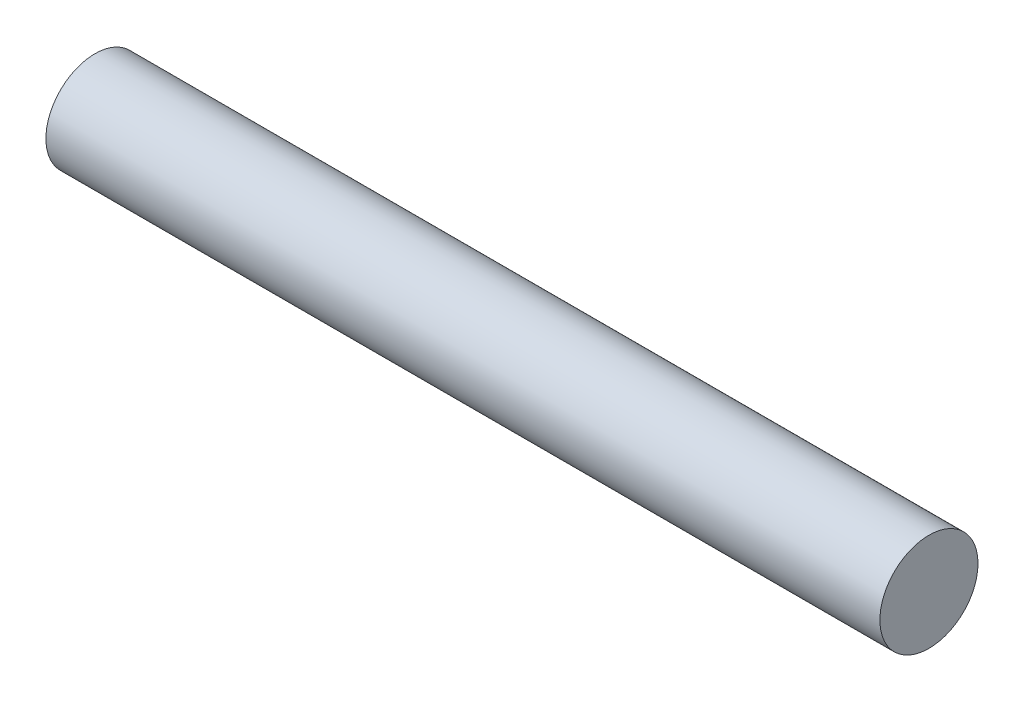
ISO-10303-21;
HEADER;
FILE_DESCRIPTION(('STEP AP214'),'2;1');
FILE_NAME('part.step','',(''),(''),'','','');
FILE_SCHEMA(('AUTOMOTIVE_DESIGN { 1 0 10303 214 1 1 1 1 }'));
ENDSEC;
DATA;
#1=APPLICATION_CONTEXT('core data for automotive mechanical design processes');
#2=APPLICATION_PROTOCOL_DEFINITION('international standard','automotive_design',2000,#1);
#3=PRODUCT_CONTEXT('',#1,'mechanical');
#4=PRODUCT('Part','Part','',(#3));
#5=PRODUCT_RELATED_PRODUCT_CATEGORY('part','',(#4));
#6=PRODUCT_DEFINITION_FORMATION('','',#4);
#7=PRODUCT_DEFINITION_CONTEXT('part definition',#1,'design');
#8=PRODUCT_DEFINITION('design','',#6,#7);
#9=PRODUCT_DEFINITION_SHAPE('','',#8);
#10=(LENGTH_UNIT() NAMED_UNIT(*) SI_UNIT(.MILLI.,.METRE.));
#11=(NAMED_UNIT(*) PLANE_ANGLE_UNIT() SI_UNIT($,.RADIAN.));
#12=(NAMED_UNIT(*) SI_UNIT($,.STERADIAN.) SOLID_ANGLE_UNIT());
#13=UNCERTAINTY_MEASURE_WITH_UNIT(LENGTH_MEASURE(1.E-05),#10,'distance_accuracy_value','');
#14=(GEOMETRIC_REPRESENTATION_CONTEXT(3) GLOBAL_UNCERTAINTY_ASSIGNED_CONTEXT((#13)) GLOBAL_UNIT_ASSIGNED_CONTEXT((#10,
#11,#12)) REPRESENTATION_CONTEXT('',''));
#15=CARTESIAN_POINT('',(0.,0.,0.));
#16=DIRECTION('',(0.,0.,1.));
#17=DIRECTION('',(1.,0.,0.));
#18=AXIS2_PLACEMENT_3D('',#15,#16,#17);
#19=CARTESIAN_POINT('',(85.,3.31415809354724,11.6387671610105));
#20=DIRECTION('',(-1.,0.,0.));
#21=DIRECTION('',(0.,0.,1.));
#22=AXIS2_PLACEMENT_3D('',#19,#20,#21);
#23=CYLINDRICAL_SURFACE('',#22,10.);
#24=CARTESIAN_POINT('',(85.,3.31415809354724,11.6387671610105));
#25=DIRECTION('',(1.,0.,0.));
#26=DIRECTION('',(0.,0.,-1.));
#27=AXIS2_PLACEMENT_3D('',#24,#25,#26);
#28=CIRCLE('',#27,10.);
#29=CARTESIAN_POINT('',(85.,3.31415809354724,1.63876716101052));
#30=VERTEX_POINT('',#29);
#31=EDGE_CURVE('E10',#30,#30,#28,.T.);
#32=ORIENTED_EDGE('',*,*,#31,.F.);
#33=EDGE_LOOP('',(#32));
#34=FACE_BOUND('',#33,.T.);
#35=CARTESIAN_POINT('',(-85.,3.31415809354724,11.6387671610105));
#36=DIRECTION('',(1.,0.,0.));
#37=DIRECTION('',(0.,0.,-1.));
#38=AXIS2_PLACEMENT_3D('',#35,#36,#37);
#39=CIRCLE('',#38,10.);
#40=CARTESIAN_POINT('',(-85.,3.31415809354724,1.63876716101052));
#41=VERTEX_POINT('',#40);
#42=EDGE_CURVE('E40',#41,#41,#39,.T.);
#43=ORIENTED_EDGE('',*,*,#42,.T.);
#44=EDGE_LOOP('',(#43));
#45=FACE_BOUND('',#44,.T.);
#46=ADVANCED_FACE('F37',(#34,#45),#23,.T.);
#47=CARTESIAN_POINT('',(85.,3.31415809354724,11.6387671610105));
#48=DIRECTION('',(1.,0.,0.));
#49=DIRECTION('',(0.,0.,-1.));
#50=AXIS2_PLACEMENT_3D('',#47,#48,#49);
#51=PLANE('',#50);
#52=ORIENTED_EDGE('',*,*,#31,.T.);
#53=EDGE_LOOP('',(#52));
#54=FACE_BOUND('',#53,.T.);
#55=ADVANCED_FACE('F54',(#54),#51,.T.);
#56=CARTESIAN_POINT('',(-85.,3.31415809354724,11.6387671610105));
#57=DIRECTION('',(1.,0.,0.));
#58=DIRECTION('',(0.,0.,-1.));
#59=AXIS2_PLACEMENT_3D('',#56,#57,#58);
#60=PLANE('',#59);
#61=ORIENTED_EDGE('',*,*,#42,.F.);
#62=EDGE_LOOP('',(#61));
#63=FACE_BOUND('',#62,.T.);
#64=ADVANCED_FACE('F52',(#63),#60,.F.);
#65=CLOSED_SHELL('',(#46,#55,#64));
#66=MANIFOLD_SOLID_BREP('B2',#65);
#67=ADVANCED_BREP_SHAPE_REPRESENTATION('',(#18,#66),#14);
#68=SHAPE_DEFINITION_REPRESENTATION(#9,#67);
ENDSEC;
END-ISO-10303-21;
